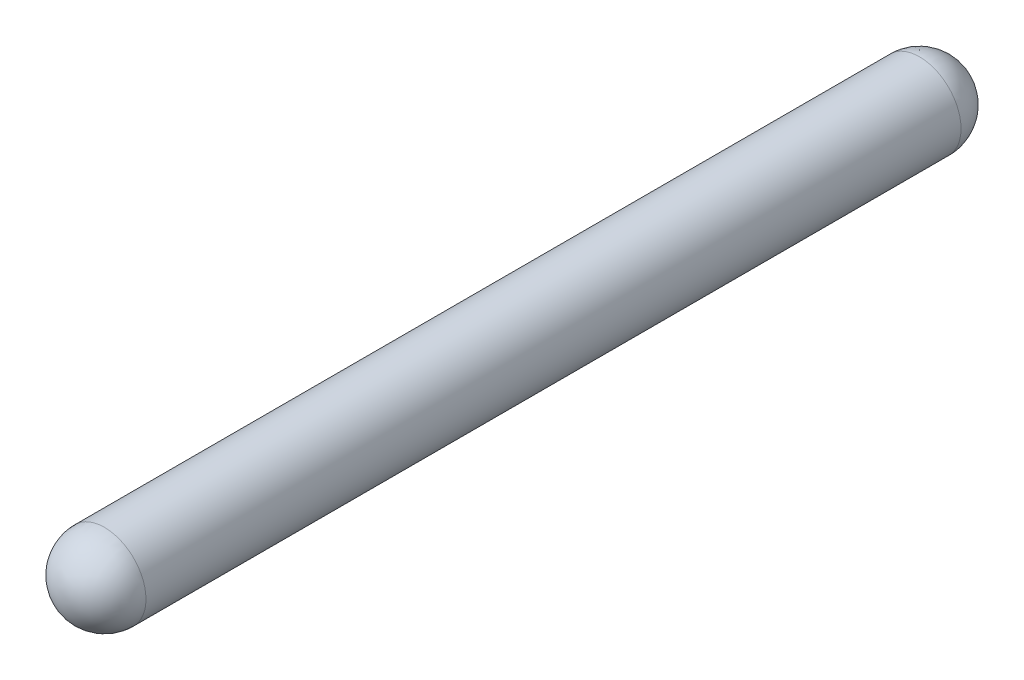
ISO-10303-21;
HEADER;
FILE_DESCRIPTION(('STEP AP214'),'2;1');
FILE_NAME('part.step','',(''),(''),'','','');
FILE_SCHEMA(('AUTOMOTIVE_DESIGN { 1 0 10303 214 1 1 1 1 }'));
ENDSEC;
DATA;
#1=APPLICATION_CONTEXT('core data for automotive mechanical design processes');
#2=APPLICATION_PROTOCOL_DEFINITION('international standard','automotive_design',2000,#1);
#3=PRODUCT_CONTEXT('',#1,'mechanical');
#4=PRODUCT('Part','Part','',(#3));
#5=PRODUCT_RELATED_PRODUCT_CATEGORY('part','',(#4));
#6=PRODUCT_DEFINITION_FORMATION('','',#4);
#7=PRODUCT_DEFINITION_CONTEXT('part definition',#1,'design');
#8=PRODUCT_DEFINITION('design','',#6,#7);
#9=PRODUCT_DEFINITION_SHAPE('','',#8);
#10=(LENGTH_UNIT() NAMED_UNIT(*) SI_UNIT(.MILLI.,.METRE.));
#11=(NAMED_UNIT(*) PLANE_ANGLE_UNIT() SI_UNIT($,.RADIAN.));
#12=(NAMED_UNIT(*) SI_UNIT($,.STERADIAN.) SOLID_ANGLE_UNIT());
#13=UNCERTAINTY_MEASURE_WITH_UNIT(LENGTH_MEASURE(1.E-05),#10,'distance_accuracy_value','');
#14=(GEOMETRIC_REPRESENTATION_CONTEXT(3) GLOBAL_UNCERTAINTY_ASSIGNED_CONTEXT((#13)) GLOBAL_UNIT_ASSIGNED_CONTEXT((#10,
#11,#12)) REPRESENTATION_CONTEXT('',''));
#15=CARTESIAN_POINT('',(0.,0.,0.));
#16=DIRECTION('',(0.,0.,1.));
#17=DIRECTION('',(1.,0.,0.));
#18=AXIS2_PLACEMENT_3D('',#15,#16,#17);
#19=CARTESIAN_POINT('',(0.,-12.7,-3.));
#20=DIRECTION('',(1.,0.,0.));
#21=DIRECTION('',(0.,-1.,0.));
#22=AXIS2_PLACEMENT_3D('',#19,#20,#21);
#23=SPHERICAL_SURFACE('',#22,0.331);
#24=CARTESIAN_POINT('',(0.,-12.7,-3.));
#25=DIRECTION('',(0.,0.,1.));
#26=DIRECTION('',(1.,0.,0.));
#27=AXIS2_PLACEMENT_3D('',#24,#25,#26);
#28=CIRCLE('',#27,0.331);
#29=CARTESIAN_POINT('',(0.331,-12.7,-3.));
#30=VERTEX_POINT('',#29);
#31=CARTESIAN_POINT('',(-0.331,-12.7,-3.));
#32=VERTEX_POINT('',#31);
#33=EDGE_CURVE('E42',#30,#32,#28,.T.);
#34=ORIENTED_EDGE('',*,*,#33,.F.);
#35=CARTESIAN_POINT('',(0.,-12.7,-3.));
#36=DIRECTION('',(0.,0.,1.));
#37=DIRECTION('',(1.,0.,0.));
#38=AXIS2_PLACEMENT_3D('',#35,#36,#37);
#39=CIRCLE('',#38,0.331);
#40=EDGE_CURVE('E26',#32,#30,#39,.T.);
#41=ORIENTED_EDGE('',*,*,#40,.F.);
#42=EDGE_LOOP('',(#34,#41));
#43=FACE_BOUND('',#42,.T.);
#44=ADVANCED_FACE('F17',(#43),#23,.T.);
#45=CARTESIAN_POINT('',(0.,-12.7,3.5));
#46=DIRECTION('',(1.,0.,0.));
#47=DIRECTION('',(0.,1.,0.));
#48=AXIS2_PLACEMENT_3D('',#45,#46,#47);
#49=SPHERICAL_SURFACE('',#48,0.331);
#50=CARTESIAN_POINT('',(0.,-12.7,3.5));
#51=DIRECTION('',(0.,0.,1.));
#52=DIRECTION('',(1.,0.,0.));
#53=AXIS2_PLACEMENT_3D('',#50,#51,#52);
#54=CIRCLE('',#53,0.331);
#55=CARTESIAN_POINT('',(0.331,-12.7,3.5));
#56=VERTEX_POINT('',#55);
#57=CARTESIAN_POINT('',(-0.331,-12.7,3.5));
#58=VERTEX_POINT('',#57);
#59=EDGE_CURVE('E11',#56,#58,#54,.F.);
#60=ORIENTED_EDGE('',*,*,#59,.F.);
#61=CARTESIAN_POINT('',(0.,-12.7,3.5));
#62=DIRECTION('',(0.,0.,1.));
#63=DIRECTION('',(1.,0.,0.));
#64=AXIS2_PLACEMENT_3D('',#61,#62,#63);
#65=CIRCLE('',#64,0.331);
#66=EDGE_CURVE('E34',#58,#56,#65,.F.);
#67=ORIENTED_EDGE('',*,*,#66,.F.);
#68=EDGE_LOOP('',(#60,#67));
#69=FACE_BOUND('',#68,.T.);
#70=ADVANCED_FACE('F49',(#69),#49,.T.);
#71=CARTESIAN_POINT('',(0.,-12.7,-3.));
#72=DIRECTION('',(0.,0.,1.));
#73=DIRECTION('',(1.,0.,0.));
#74=AXIS2_PLACEMENT_3D('',#71,#72,#73);
#75=CYLINDRICAL_SURFACE('',#74,0.331);
#76=ORIENTED_EDGE('',*,*,#66,.T.);
#77=ORIENTED_EDGE('',*,*,#59,.T.);
#78=EDGE_LOOP('',(#76,#77));
#79=FACE_BOUND('',#78,.T.);
#80=ORIENTED_EDGE('',*,*,#40,.T.);
#81=ORIENTED_EDGE('',*,*,#33,.T.);
#82=EDGE_LOOP('',(#80,#81));
#83=FACE_BOUND('',#82,.T.);
#84=ADVANCED_FACE('F45',(#79,#83),#75,.T.);
#85=CLOSED_SHELL('',(#44,#70,#84));
#86=MANIFOLD_SOLID_BREP('B1',#85);
#87=ADVANCED_BREP_SHAPE_REPRESENTATION('',(#18,#86),#14);
#88=SHAPE_DEFINITION_REPRESENTATION(#9,#87);
ENDSEC;
END-ISO-10303-21;
